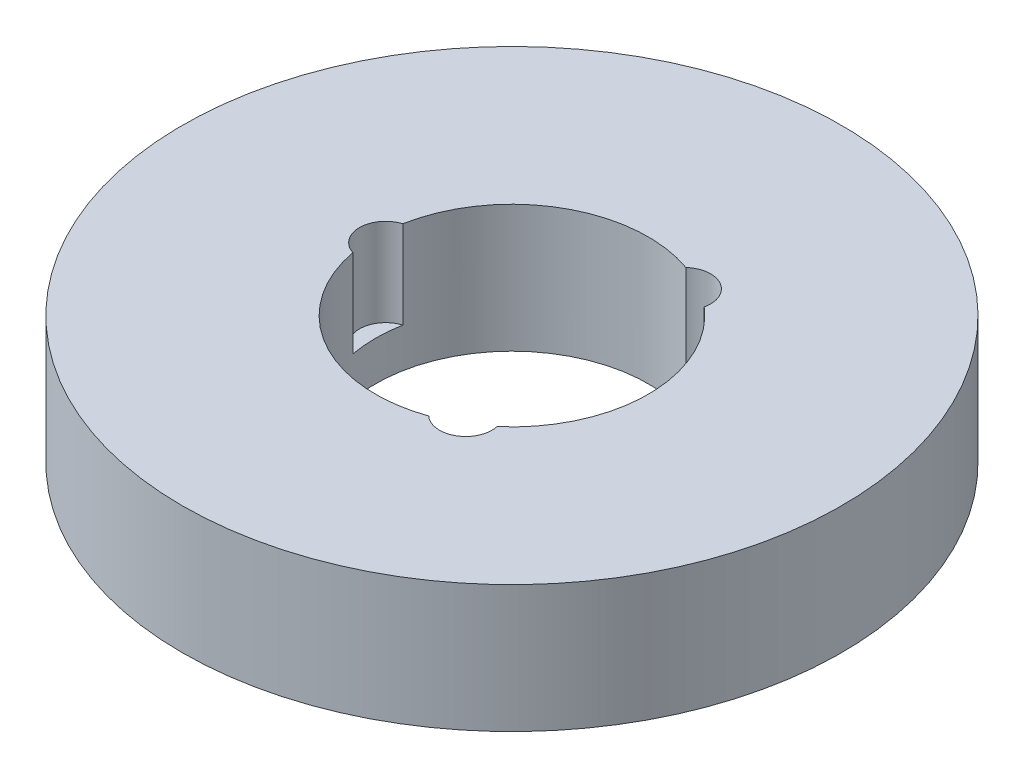
ISO-10303-21;
HEADER;
FILE_DESCRIPTION(('STEP AP214'),'2;1');
FILE_NAME('part.step','',(''),(''),'','','');
FILE_SCHEMA(('AUTOMOTIVE_DESIGN { 1 0 10303 214 1 1 1 1 }'));
ENDSEC;
DATA;
#1=APPLICATION_CONTEXT('core data for automotive mechanical design processes');
#2=APPLICATION_PROTOCOL_DEFINITION('international standard','automotive_design',2000,#1);
#3=PRODUCT_CONTEXT('',#1,'mechanical');
#4=PRODUCT('Part','Part','',(#3));
#5=PRODUCT_RELATED_PRODUCT_CATEGORY('part','',(#4));
#6=PRODUCT_DEFINITION_FORMATION('','',#4);
#7=PRODUCT_DEFINITION_CONTEXT('part definition',#1,'design');
#8=PRODUCT_DEFINITION('design','',#6,#7);
#9=PRODUCT_DEFINITION_SHAPE('','',#8);
#10=(LENGTH_UNIT() NAMED_UNIT(*) SI_UNIT(.MILLI.,.METRE.));
#11=(NAMED_UNIT(*) PLANE_ANGLE_UNIT() SI_UNIT($,.RADIAN.));
#12=(NAMED_UNIT(*) SI_UNIT($,.STERADIAN.) SOLID_ANGLE_UNIT());
#13=UNCERTAINTY_MEASURE_WITH_UNIT(LENGTH_MEASURE(1.E-05),#10,'distance_accuracy_value','');
#14=(GEOMETRIC_REPRESENTATION_CONTEXT(3) GLOBAL_UNCERTAINTY_ASSIGNED_CONTEXT((#13)) GLOBAL_UNIT_ASSIGNED_CONTEXT((#10,
#11,#12)) REPRESENTATION_CONTEXT('',''));
#15=CARTESIAN_POINT('',(0.,0.,0.));
#16=DIRECTION('',(0.,0.,1.));
#17=DIRECTION('',(1.,0.,0.));
#18=AXIS2_PLACEMENT_3D('',#15,#16,#17);
#19=CARTESIAN_POINT('',(0.,28.,0.));
#20=DIRECTION('',(0.,-1.,0.));
#21=DIRECTION('',(0.,0.,-1.));
#22=AXIS2_PLACEMENT_3D('',#19,#20,#21);
#23=CYLINDRICAL_SURFACE('',#22,72.5);
#24=CARTESIAN_POINT('',(0.,28.,0.));
#25=DIRECTION('',(0.,1.,0.));
#26=DIRECTION('',(0.,0.,1.));
#27=AXIS2_PLACEMENT_3D('',#24,#25,#26);
#28=CIRCLE('',#27,72.5);
#29=CARTESIAN_POINT('',(0.,28.,72.5));
#30=VERTEX_POINT('',#29);
#31=EDGE_CURVE('E130',#30,#30,#28,.T.);
#32=ORIENTED_EDGE('',*,*,#31,.F.);
#33=EDGE_LOOP('',(#32));
#34=FACE_BOUND('',#33,.T.);
#35=CARTESIAN_POINT('',(0.,0.,0.));
#36=DIRECTION('',(0.,1.,0.));
#37=DIRECTION('',(0.,0.,1.));
#38=AXIS2_PLACEMENT_3D('',#35,#36,#37);
#39=CIRCLE('',#38,72.5);
#40=CARTESIAN_POINT('',(0.,0.,72.5));
#41=VERTEX_POINT('',#40);
#42=EDGE_CURVE('E117',#41,#41,#39,.T.);
#43=ORIENTED_EDGE('',*,*,#42,.T.);
#44=EDGE_LOOP('',(#43));
#45=FACE_BOUND('',#44,.T.);
#46=ADVANCED_FACE('F39',(#34,#45),#23,.T.);
#47=CARTESIAN_POINT('',(0.,28.,0.));
#48=DIRECTION('',(0.,1.,0.));
#49=DIRECTION('',(0.,0.,1.));
#50=AXIS2_PLACEMENT_3D('',#47,#48,#49);
#51=PLANE('',#50);
#52=CARTESIAN_POINT('',(13.886322642654,28.,24.0518163473706));
#53=DIRECTION('',(0.,1.,0.));
#54=DIRECTION('',(0.866025403784436,0.,-0.500000000000004));
#55=AXIS2_PLACEMENT_3D('',#52,#53,#54);
#56=CIRCLE('',#55,5.76156958344864);
#57=CARTESIAN_POINT('',(9.98344297537253,28.,28.2901195889569));
#58=VERTEX_POINT('',#57);
#59=CARTESIAN_POINT('',(19.5082407524504,28.,22.7909750283842));
#60=VERTEX_POINT('',#59);
#61=EDGE_CURVE('E148',#58,#60,#56,.T.);
#62=ORIENTED_EDGE('',*,*,#61,.F.);
#63=CARTESIAN_POINT('',(0.,28.,0.));
#64=DIRECTION('',(0.,1.,0.));
#65=DIRECTION('',(0.,0.,1.));
#66=AXIS2_PLACEMENT_3D('',#63,#64,#65);
#67=CIRCLE('',#66,30.);
#68=CARTESIAN_POINT('',(-29.4916837278227,28.,5.4991445605727));
#69=VERTEX_POINT('',#68);
#70=EDGE_CURVE('E113',#69,#58,#67,.T.);
#71=ORIENTED_EDGE('',*,*,#70,.F.);
#72=CARTESIAN_POINT('',(-27.7726452853078,28.,0.));
#73=DIRECTION('',(0.,1.,0.));
#74=DIRECTION('',(0.,0.,1.));
#75=AXIS2_PLACEMENT_3D('',#72,#73,#74);
#76=CIRCLE('',#75,5.76156958344864);
#77=CARTESIAN_POINT('',(-29.4916837278227,28.,-5.4991445605727));
#78=VERTEX_POINT('',#77);
#79=EDGE_CURVE('E125',#78,#69,#76,.T.);
#80=ORIENTED_EDGE('',*,*,#79,.F.);
#81=CARTESIAN_POINT('',(9.98344297537213,28.,-28.2901195889571));
#82=VERTEX_POINT('',#81);
#83=EDGE_CURVE('E107',#82,#78,#67,.T.);
#84=ORIENTED_EDGE('',*,*,#83,.F.);
#85=CARTESIAN_POINT('',(13.8863226426537,28.,-24.0518163473708));
#86=DIRECTION('',(0.,1.,0.));
#87=DIRECTION('',(-0.866025403784443,0.,-0.499999999999992));
#88=AXIS2_PLACEMENT_3D('',#85,#86,#87);
#89=CIRCLE('',#88,5.76156958344864);
#90=CARTESIAN_POINT('',(19.5082407524501,28.,-22.7909750283845));
#91=VERTEX_POINT('',#90);
#92=EDGE_CURVE('E95',#91,#82,#89,.T.);
#93=ORIENTED_EDGE('',*,*,#92,.F.);
#94=EDGE_CURVE('E106',#60,#91,#67,.T.);
#95=ORIENTED_EDGE('',*,*,#94,.F.);
#96=EDGE_LOOP('',(#62,#71,#80,#84,#93,#95));
#97=FACE_BOUND('',#96,.T.);
#98=ORIENTED_EDGE('',*,*,#31,.T.);
#99=EDGE_LOOP('',(#98));
#100=FACE_BOUND('',#99,.T.);
#101=ADVANCED_FACE('F102',(#97,#100),#51,.T.);
#102=CARTESIAN_POINT('',(0.,0.,0.));
#103=DIRECTION('',(0.,1.,0.));
#104=DIRECTION('',(0.,0.,1.));
#105=AXIS2_PLACEMENT_3D('',#102,#103,#104);
#106=PLANE('',#105);
#107=CARTESIAN_POINT('',(0.,0.,0.));
#108=DIRECTION('',(0.,1.,0.));
#109=DIRECTION('',(0.,0.,1.));
#110=AXIS2_PLACEMENT_3D('',#107,#108,#109);
#111=CIRCLE('',#110,30.);
#112=CARTESIAN_POINT('',(0.,0.,30.));
#113=VERTEX_POINT('',#112);
#114=EDGE_CURVE('E118',#113,#113,#111,.T.);
#115=ORIENTED_EDGE('',*,*,#114,.T.);
#116=EDGE_LOOP('',(#115));
#117=FACE_BOUND('',#116,.T.);
#118=ORIENTED_EDGE('',*,*,#42,.F.);
#119=EDGE_LOOP('',(#118));
#120=FACE_BOUND('',#119,.T.);
#121=ADVANCED_FACE('F161',(#117,#120),#106,.F.);
#122=CARTESIAN_POINT('',(0.,28.,0.));
#123=DIRECTION('',(0.,-1.,0.));
#124=DIRECTION('',(0.,0.,-1.));
#125=AXIS2_PLACEMENT_3D('',#122,#123,#124);
#126=CYLINDRICAL_SURFACE('',#125,30.);
#127=DIRECTION('',(0.,1.,0.));
#128=VECTOR('',#127,1.);
#129=CARTESIAN_POINT('',(9.98344297537252,18.3448783665847,28.2901195889569));
#130=LINE('',#129,#128);
#131=CARTESIAN_POINT('',(9.98344297537253,8.68975673316941,28.2901195889569));
#132=VERTEX_POINT('',#131);
#133=EDGE_CURVE('E11',#132,#58,#130,.T.);
#134=ORIENTED_EDGE('',*,*,#133,.F.);
#135=CARTESIAN_POINT('',(0.,8.68975673316941,0.));
#136=DIRECTION('',(0.,1.,0.));
#137=DIRECTION('',(0.,0.,1.));
#138=AXIS2_PLACEMENT_3D('',#135,#136,#137);
#139=CIRCLE('',#138,30.);
#140=CARTESIAN_POINT('',(19.5082407524504,8.68975673316941,22.7909750283842));
#141=VERTEX_POINT('',#140);
#142=EDGE_CURVE('E100',#132,#141,#139,.T.);
#143=ORIENTED_EDGE('',*,*,#142,.T.);
#144=DIRECTION('',(0.,1.,0.));
#145=VECTOR('',#144,1.);
#146=CARTESIAN_POINT('',(19.5082407524504,18.3448783665847,22.7909750283842));
#147=LINE('',#146,#145);
#148=EDGE_CURVE('E46',#60,#141,#147,.F.);
#149=ORIENTED_EDGE('',*,*,#148,.F.);
#150=ORIENTED_EDGE('',*,*,#94,.T.);
#151=DIRECTION('',(0.,1.,0.));
#152=VECTOR('',#151,1.);
#153=CARTESIAN_POINT('',(19.5082407524501,18.3448783665847,-22.7909750283845));
#154=LINE('',#153,#152);
#155=CARTESIAN_POINT('',(19.5082407524501,8.68975673316941,-22.7909750283845));
#156=VERTEX_POINT('',#155);
#157=EDGE_CURVE('E90',#156,#91,#154,.T.);
#158=ORIENTED_EDGE('',*,*,#157,.F.);
#159=CARTESIAN_POINT('',(0.,8.68975673316941,0.));
#160=DIRECTION('',(0.,1.,0.));
#161=DIRECTION('',(0.,0.,1.));
#162=AXIS2_PLACEMENT_3D('',#159,#160,#161);
#163=CIRCLE('',#162,30.);
#164=CARTESIAN_POINT('',(9.98344297537213,8.68975673316941,-28.2901195889571));
#165=VERTEX_POINT('',#164);
#166=EDGE_CURVE('E143',#156,#165,#163,.T.);
#167=ORIENTED_EDGE('',*,*,#166,.T.);
#168=DIRECTION('',(0.,1.,0.));
#169=VECTOR('',#168,1.);
#170=CARTESIAN_POINT('',(9.98344297537213,18.3448783665847,-28.2901195889571));
#171=LINE('',#170,#169);
#172=EDGE_CURVE('E98',#82,#165,#171,.F.);
#173=ORIENTED_EDGE('',*,*,#172,.F.);
#174=ORIENTED_EDGE('',*,*,#83,.T.);
#175=DIRECTION('',(0.,1.,0.));
#176=VECTOR('',#175,1.);
#177=CARTESIAN_POINT('',(-29.4916837278227,18.3448783665847,-5.4991445605727));
#178=LINE('',#177,#176);
#179=CARTESIAN_POINT('',(-29.4916837278227,8.68975673316941,-5.4991445605727));
#180=VERTEX_POINT('',#179);
#181=EDGE_CURVE('E137',#180,#78,#178,.T.);
#182=ORIENTED_EDGE('',*,*,#181,.F.);
#183=CARTESIAN_POINT('',(0.,8.68975673316941,0.));
#184=DIRECTION('',(0.,1.,0.));
#185=DIRECTION('',(0.,0.,1.));
#186=AXIS2_PLACEMENT_3D('',#183,#184,#185);
#187=CIRCLE('',#186,30.);
#188=CARTESIAN_POINT('',(-29.4916837278227,8.68975673316941,5.4991445605727));
#189=VERTEX_POINT('',#188);
#190=EDGE_CURVE('E128',#180,#189,#187,.T.);
#191=ORIENTED_EDGE('',*,*,#190,.T.);
#192=DIRECTION('',(0.,1.,0.));
#193=VECTOR('',#192,1.);
#194=CARTESIAN_POINT('',(-29.4916837278227,18.3448783665847,5.4991445605727));
#195=LINE('',#194,#193);
#196=EDGE_CURVE('E134',#69,#189,#195,.F.);
#197=ORIENTED_EDGE('',*,*,#196,.F.);
#198=ORIENTED_EDGE('',*,*,#70,.T.);
#199=EDGE_LOOP('',(#134,#143,#149,#150,#158,#167,#173,#174,#182,#191,#197,#198));
#200=FACE_BOUND('',#199,.T.);
#201=ORIENTED_EDGE('',*,*,#114,.F.);
#202=EDGE_LOOP('',(#201));
#203=FACE_BOUND('',#202,.T.);
#204=ADVANCED_FACE('F115',(#200,#203),#126,.F.);
#205=CARTESIAN_POINT('',(-27.7726452853078,8.68975673316941,0.));
#206=DIRECTION('',(0.,1.,0.));
#207=DIRECTION('',(0.,0.,1.));
#208=AXIS2_PLACEMENT_3D('',#205,#206,#207);
#209=CYLINDRICAL_SURFACE('',#208,5.76156958344864);
#210=ORIENTED_EDGE('',*,*,#181,.T.);
#211=ORIENTED_EDGE('',*,*,#79,.T.);
#212=ORIENTED_EDGE('',*,*,#196,.T.);
#213=CARTESIAN_POINT('',(-27.7726452853078,8.68975673316941,0.));
#214=DIRECTION('',(0.,1.,0.));
#215=DIRECTION('',(0.,0.,1.));
#216=AXIS2_PLACEMENT_3D('',#213,#214,#215);
#217=CIRCLE('',#216,5.76156958344864);
#218=EDGE_CURVE('E127',#180,#189,#217,.T.);
#219=ORIENTED_EDGE('',*,*,#218,.F.);
#220=EDGE_LOOP('',(#210,#211,#212,#219));
#221=FACE_BOUND('',#220,.T.);
#222=ADVANCED_FACE('F175',(#221),#209,.F.);
#223=CARTESIAN_POINT('',(-27.7726452853078,8.68975673316941,0.));
#224=DIRECTION('',(0.,1.,0.));
#225=DIRECTION('',(0.,0.,1.));
#226=AXIS2_PLACEMENT_3D('',#223,#224,#225);
#227=PLANE('',#226);
#228=ORIENTED_EDGE('',*,*,#218,.T.);
#229=ORIENTED_EDGE('',*,*,#190,.F.);
#230=EDGE_LOOP('',(#228,#229));
#231=FACE_BOUND('',#230,.T.);
#232=ADVANCED_FACE('F176',(#231),#227,.T.);
#233=CARTESIAN_POINT('',(13.8863226426537,8.68975673316941,-24.0518163473708));
#234=DIRECTION('',(0.,1.,0.));
#235=DIRECTION('',(0.,0.,1.));
#236=AXIS2_PLACEMENT_3D('',#233,#234,#235);
#237=CYLINDRICAL_SURFACE('',#236,5.76156958344864);
#238=ORIENTED_EDGE('',*,*,#157,.T.);
#239=ORIENTED_EDGE('',*,*,#92,.T.);
#240=ORIENTED_EDGE('',*,*,#172,.T.);
#241=CARTESIAN_POINT('',(13.8863226426537,8.68975673316941,-24.0518163473708));
#242=DIRECTION('',(0.,1.,0.));
#243=DIRECTION('',(-0.866025403784443,0.,-0.499999999999992));
#244=AXIS2_PLACEMENT_3D('',#241,#242,#243);
#245=CIRCLE('',#244,5.76156958344864);
#246=EDGE_CURVE('E56',#156,#165,#245,.T.);
#247=ORIENTED_EDGE('',*,*,#246,.F.);
#248=EDGE_LOOP('',(#238,#239,#240,#247));
#249=FACE_BOUND('',#248,.T.);
#250=ADVANCED_FACE('F93',(#249),#237,.F.);
#251=CARTESIAN_POINT('',(13.8863226426537,8.68975673316941,-24.0518163473708));
#252=DIRECTION('',(0.,1.,0.));
#253=DIRECTION('',(-0.866025403784443,0.,-0.499999999999992));
#254=AXIS2_PLACEMENT_3D('',#251,#252,#253);
#255=PLANE('',#254);
#256=ORIENTED_EDGE('',*,*,#246,.T.);
#257=ORIENTED_EDGE('',*,*,#166,.F.);
#258=EDGE_LOOP('',(#256,#257));
#259=FACE_BOUND('',#258,.T.);
#260=ADVANCED_FACE('F153',(#259),#255,.T.);
#261=CARTESIAN_POINT('',(13.886322642654,8.68975673316941,24.0518163473706));
#262=DIRECTION('',(0.,1.,0.));
#263=DIRECTION('',(0.,0.,1.));
#264=AXIS2_PLACEMENT_3D('',#261,#262,#263);
#265=CYLINDRICAL_SURFACE('',#264,5.76156958344864);
#266=ORIENTED_EDGE('',*,*,#133,.T.);
#267=ORIENTED_EDGE('',*,*,#61,.T.);
#268=ORIENTED_EDGE('',*,*,#148,.T.);
#269=CARTESIAN_POINT('',(13.886322642654,8.68975673316941,24.0518163473706));
#270=DIRECTION('',(0.,1.,0.));
#271=DIRECTION('',(0.866025403784436,0.,-0.500000000000004));
#272=AXIS2_PLACEMENT_3D('',#269,#270,#271);
#273=CIRCLE('',#272,5.76156958344864);
#274=EDGE_CURVE('E55',#132,#141,#273,.T.);
#275=ORIENTED_EDGE('',*,*,#274,.F.);
#276=EDGE_LOOP('',(#266,#267,#268,#275));
#277=FACE_BOUND('',#276,.T.);
#278=ADVANCED_FACE('F144',(#277),#265,.F.);
#279=CARTESIAN_POINT('',(13.886322642654,8.68975673316941,24.0518163473706));
#280=DIRECTION('',(0.,1.,0.));
#281=DIRECTION('',(0.866025403784436,0.,-0.500000000000004));
#282=AXIS2_PLACEMENT_3D('',#279,#280,#281);
#283=PLANE('',#282);
#284=ORIENTED_EDGE('',*,*,#274,.T.);
#285=ORIENTED_EDGE('',*,*,#142,.F.);
#286=EDGE_LOOP('',(#284,#285));
#287=FACE_BOUND('',#286,.T.);
#288=ADVANCED_FACE('F150',(#287),#283,.T.);
#289=CLOSED_SHELL('',(#46,#101,#121,#204,#222,#232,#250,#260,#278,#288));
#290=MANIFOLD_SOLID_BREP('B2',#289);
#291=ADVANCED_BREP_SHAPE_REPRESENTATION('',(#18,#290),#14);
#292=SHAPE_DEFINITION_REPRESENTATION(#9,#291);
ENDSEC;
END-ISO-10303-21;
